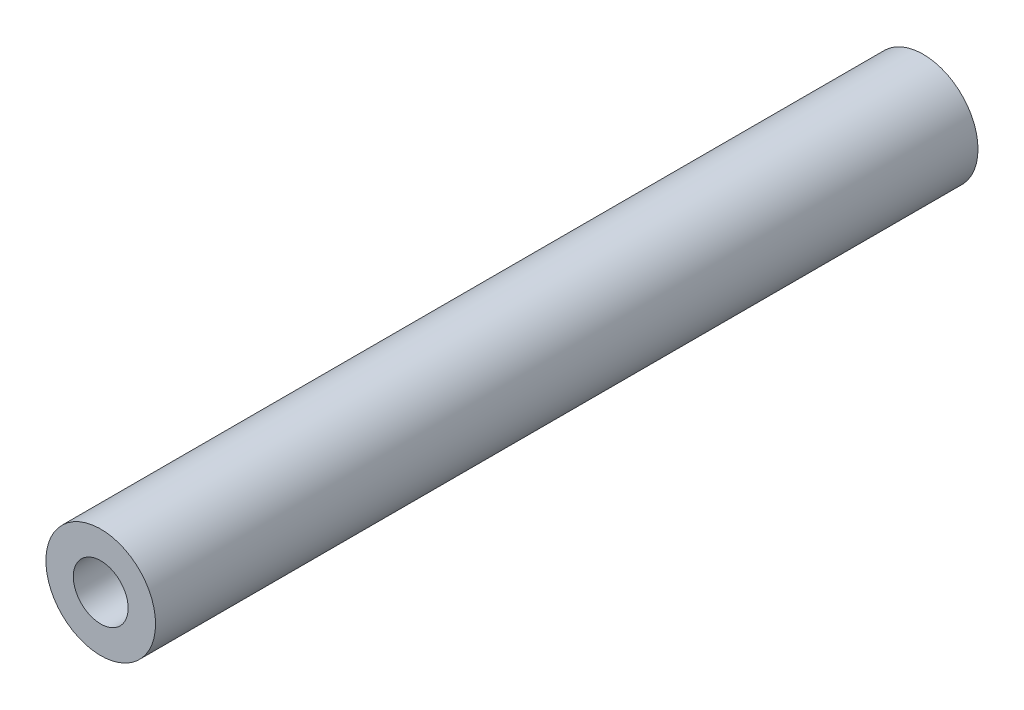
ISO-10303-21;
HEADER;
FILE_DESCRIPTION(('STEP AP214'),'2;1');
FILE_NAME('part.step','',(''),(''),'','','');
FILE_SCHEMA(('AUTOMOTIVE_DESIGN { 1 0 10303 214 1 1 1 1 }'));
ENDSEC;
DATA;
#1=APPLICATION_CONTEXT('core data for automotive mechanical design processes');
#2=APPLICATION_PROTOCOL_DEFINITION('international standard','automotive_design',2000,#1);
#3=PRODUCT_CONTEXT('',#1,'mechanical');
#4=PRODUCT('Part','Part','',(#3));
#5=PRODUCT_RELATED_PRODUCT_CATEGORY('part','',(#4));
#6=PRODUCT_DEFINITION_FORMATION('','',#4);
#7=PRODUCT_DEFINITION_CONTEXT('part definition',#1,'design');
#8=PRODUCT_DEFINITION('design','',#6,#7);
#9=PRODUCT_DEFINITION_SHAPE('','',#8);
#10=(LENGTH_UNIT() NAMED_UNIT(*) SI_UNIT(.MILLI.,.METRE.));
#11=(NAMED_UNIT(*) PLANE_ANGLE_UNIT() SI_UNIT($,.RADIAN.));
#12=(NAMED_UNIT(*) SI_UNIT($,.STERADIAN.) SOLID_ANGLE_UNIT());
#13=UNCERTAINTY_MEASURE_WITH_UNIT(LENGTH_MEASURE(1.E-05),#10,'distance_accuracy_value','');
#14=(GEOMETRIC_REPRESENTATION_CONTEXT(3) GLOBAL_UNCERTAINTY_ASSIGNED_CONTEXT((#13)) GLOBAL_UNIT_ASSIGNED_CONTEXT((#10,
#11,#12)) REPRESENTATION_CONTEXT('',''));
#15=CARTESIAN_POINT('',(0.,0.,0.));
#16=DIRECTION('',(0.,0.,1.));
#17=DIRECTION('',(1.,0.,0.));
#18=AXIS2_PLACEMENT_3D('',#15,#16,#17);
#19=CARTESIAN_POINT('',(0.,0.,22.5));
#20=DIRECTION('',(0.,0.,1.));
#21=DIRECTION('',(1.,0.,0.));
#22=AXIS2_PLACEMENT_3D('',#19,#20,#21);
#23=PLANE('',#22);
#24=CARTESIAN_POINT('',(0.,0.,22.5));
#25=DIRECTION('',(0.,0.,1.));
#26=DIRECTION('',(1.,0.,0.));
#27=AXIS2_PLACEMENT_3D('',#24,#25,#26);
#28=CIRCLE('',#27,3.);
#29=CARTESIAN_POINT('',(3.,0.,22.5));
#30=VERTEX_POINT('',#29);
#31=EDGE_CURVE('E10',#30,#30,#28,.T.);
#32=ORIENTED_EDGE('',*,*,#31,.T.);
#33=EDGE_LOOP('',(#32));
#34=FACE_BOUND('',#33,.T.);
#35=CARTESIAN_POINT('',(0.,0.,22.5));
#36=DIRECTION('',(0.,0.,1.));
#37=DIRECTION('',(1.,0.,0.));
#38=AXIS2_PLACEMENT_3D('',#35,#36,#37);
#39=CIRCLE('',#38,1.5);
#40=CARTESIAN_POINT('',(1.5,0.,22.5));
#41=VERTEX_POINT('',#40);
#42=EDGE_CURVE('E42',#41,#41,#39,.T.);
#43=ORIENTED_EDGE('',*,*,#42,.F.);
#44=EDGE_LOOP('',(#43));
#45=FACE_BOUND('',#44,.T.);
#46=ADVANCED_FACE('F31',(#34,#45),#23,.T.);
#47=CARTESIAN_POINT('',(0.,0.,-22.5));
#48=DIRECTION('',(0.,0.,1.));
#49=DIRECTION('',(1.,0.,0.));
#50=AXIS2_PLACEMENT_3D('',#47,#48,#49);
#51=PLANE('',#50);
#52=CARTESIAN_POINT('',(0.,0.,-22.5));
#53=DIRECTION('',(0.,0.,1.));
#54=DIRECTION('',(1.,0.,0.));
#55=AXIS2_PLACEMENT_3D('',#52,#53,#54);
#56=CIRCLE('',#55,3.);
#57=CARTESIAN_POINT('',(3.,0.,-22.5));
#58=VERTEX_POINT('',#57);
#59=EDGE_CURVE('E35',#58,#58,#56,.T.);
#60=ORIENTED_EDGE('',*,*,#59,.F.);
#61=EDGE_LOOP('',(#60));
#62=FACE_BOUND('',#61,.T.);
#63=CARTESIAN_POINT('',(0.,0.,-22.5));
#64=DIRECTION('',(0.,0.,1.));
#65=DIRECTION('',(1.,0.,0.));
#66=AXIS2_PLACEMENT_3D('',#63,#64,#65);
#67=CIRCLE('',#66,1.5);
#68=CARTESIAN_POINT('',(1.5,0.,-22.5));
#69=VERTEX_POINT('',#68);
#70=EDGE_CURVE('E44',#69,#69,#67,.T.);
#71=ORIENTED_EDGE('',*,*,#70,.T.);
#72=EDGE_LOOP('',(#71));
#73=FACE_BOUND('',#72,.T.);
#74=ADVANCED_FACE('F54',(#62,#73),#51,.F.);
#75=CARTESIAN_POINT('',(0.,0.,22.5));
#76=DIRECTION('',(0.,0.,-1.));
#77=DIRECTION('',(-1.,0.,0.));
#78=AXIS2_PLACEMENT_3D('',#75,#76,#77);
#79=CYLINDRICAL_SURFACE('',#78,3.);
#80=ORIENTED_EDGE('',*,*,#31,.F.);
#81=EDGE_LOOP('',(#80));
#82=FACE_BOUND('',#81,.T.);
#83=ORIENTED_EDGE('',*,*,#59,.T.);
#84=EDGE_LOOP('',(#83));
#85=FACE_BOUND('',#84,.T.);
#86=ADVANCED_FACE('F33',(#82,#85),#79,.T.);
#87=CARTESIAN_POINT('',(0.,0.,22.5));
#88=DIRECTION('',(0.,0.,-1.));
#89=DIRECTION('',(-1.,0.,0.));
#90=AXIS2_PLACEMENT_3D('',#87,#88,#89);
#91=CYLINDRICAL_SURFACE('',#90,1.5);
#92=ORIENTED_EDGE('',*,*,#42,.T.);
#93=EDGE_LOOP('',(#92));
#94=FACE_BOUND('',#93,.T.);
#95=ORIENTED_EDGE('',*,*,#70,.F.);
#96=EDGE_LOOP('',(#95));
#97=FACE_BOUND('',#96,.T.);
#98=ADVANCED_FACE('F50',(#94,#97),#91,.F.);
#99=CLOSED_SHELL('',(#46,#74,#86,#98));
#100=MANIFOLD_SOLID_BREP('B2',#99);
#101=ADVANCED_BREP_SHAPE_REPRESENTATION('',(#18,#100),#14);
#102=SHAPE_DEFINITION_REPRESENTATION(#9,#101);
ENDSEC;
END-ISO-10303-21;
